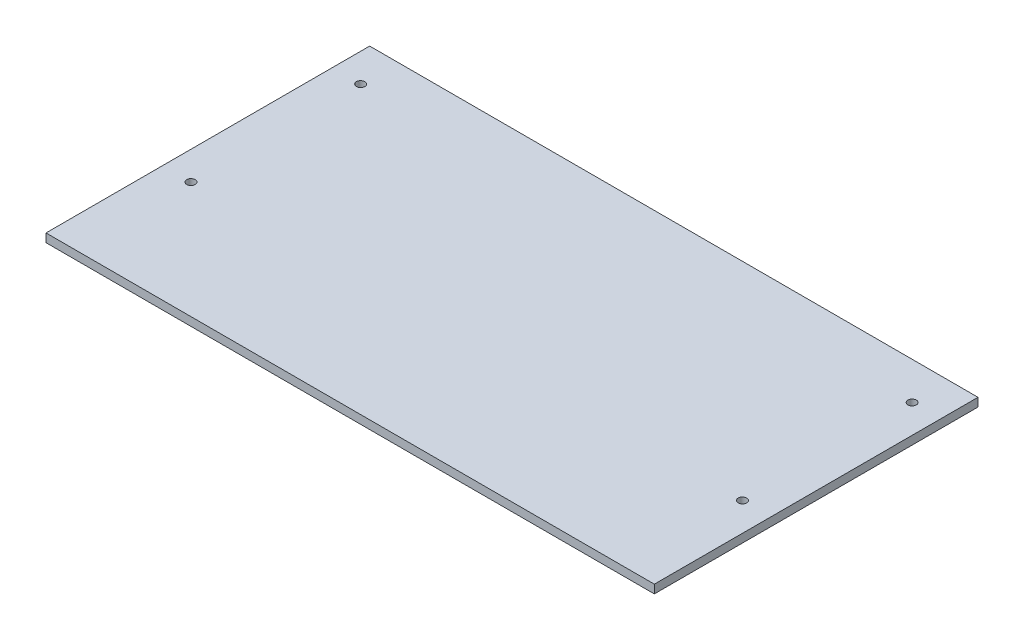
ISO-10303-21;
HEADER;
FILE_DESCRIPTION(('STEP AP214'),'2;1');
FILE_NAME('part.step','',(''),(''),'','','');
FILE_SCHEMA(('AUTOMOTIVE_DESIGN { 1 0 10303 214 1 1 1 1 }'));
ENDSEC;
DATA;
#1=APPLICATION_CONTEXT('core data for automotive mechanical design processes');
#2=APPLICATION_PROTOCOL_DEFINITION('international standard','automotive_design',2000,#1);
#3=PRODUCT_CONTEXT('',#1,'mechanical');
#4=PRODUCT('Part','Part','',(#3));
#5=PRODUCT_RELATED_PRODUCT_CATEGORY('part','',(#4));
#6=PRODUCT_DEFINITION_FORMATION('','',#4);
#7=PRODUCT_DEFINITION_CONTEXT('part definition',#1,'design');
#8=PRODUCT_DEFINITION('design','',#6,#7);
#9=PRODUCT_DEFINITION_SHAPE('','',#8);
#10=(LENGTH_UNIT() NAMED_UNIT(*) SI_UNIT(.MILLI.,.METRE.));
#11=(NAMED_UNIT(*) PLANE_ANGLE_UNIT() SI_UNIT($,.RADIAN.));
#12=(NAMED_UNIT(*) SI_UNIT($,.STERADIAN.) SOLID_ANGLE_UNIT());
#13=UNCERTAINTY_MEASURE_WITH_UNIT(LENGTH_MEASURE(1.E-05),#10,'distance_accuracy_value','');
#14=(GEOMETRIC_REPRESENTATION_CONTEXT(3) GLOBAL_UNCERTAINTY_ASSIGNED_CONTEXT((#13)) GLOBAL_UNIT_ASSIGNED_CONTEXT((#10,
#11,#12)) REPRESENTATION_CONTEXT('',''));
#15=CARTESIAN_POINT('',(0.,0.,0.));
#16=DIRECTION('',(0.,0.,1.));
#17=DIRECTION('',(1.,0.,0.));
#18=AXIS2_PLACEMENT_3D('',#15,#16,#17);
#19=CARTESIAN_POINT('',(0.,3.,0.));
#20=DIRECTION('',(0.,-1.,0.));
#21=DIRECTION('',(0.,0.,-1.));
#22=AXIS2_PLACEMENT_3D('',#19,#20,#21);
#23=PLANE('',#22);
#24=DIRECTION('',(0.,0.,-1.));
#25=VECTOR('',#24,1.);
#26=CARTESIAN_POINT('',(107.545,3.,24.1233569512786));
#27=LINE('',#26,#25);
#28=CARTESIAN_POINT('',(107.545,3.,24.1233569512786));
#29=VERTEX_POINT('',#28);
#30=CARTESIAN_POINT('',(107.545,3.,-90.3123533494948));
#31=VERTEX_POINT('',#30);
#32=EDGE_CURVE('E95',#29,#31,#27,.T.);
#33=ORIENTED_EDGE('',*,*,#32,.T.);
#34=DIRECTION('',(-1.,0.,0.));
#35=VECTOR('',#34,1.);
#36=CARTESIAN_POINT('',(-107.545,3.,-90.3123533494948));
#37=LINE('',#36,#35);
#38=CARTESIAN_POINT('',(-107.545,3.,-90.3123533494948));
#39=VERTEX_POINT('',#38);
#40=EDGE_CURVE('E90',#31,#39,#37,.T.);
#41=ORIENTED_EDGE('',*,*,#40,.T.);
#42=DIRECTION('',(0.,0.,1.));
#43=VECTOR('',#42,1.);
#44=CARTESIAN_POINT('',(-107.545,3.,-90.3123533494948));
#45=LINE('',#44,#43);
#46=CARTESIAN_POINT('',(-107.545,3.,24.1233569512786));
#47=VERTEX_POINT('',#46);
#48=EDGE_CURVE('E93',#39,#47,#45,.T.);
#49=ORIENTED_EDGE('',*,*,#48,.T.);
#50=DIRECTION('',(1.,0.,0.));
#51=VECTOR('',#50,1.);
#52=CARTESIAN_POINT('',(-107.545,3.,24.1233569512786));
#53=LINE('',#52,#51);
#54=EDGE_CURVE('E60',#47,#29,#53,.T.);
#55=ORIENTED_EDGE('',*,*,#54,.T.);
#56=EDGE_LOOP('',(#33,#41,#49,#55));
#57=FACE_BOUND('',#56,.T.);
#58=CARTESIAN_POINT('',(-97.495,3.,-77.0727083333333));
#59=DIRECTION('',(0.,1.,0.));
#60=DIRECTION('',(0.,0.,1.));
#61=AXIS2_PLACEMENT_3D('',#58,#59,#60);
#62=CIRCLE('',#61,1.5);
#63=CARTESIAN_POINT('',(-97.495,3.,-75.5727083333333));
#64=VERTEX_POINT('',#63);
#65=EDGE_CURVE('E110',#64,#64,#62,.T.);
#66=ORIENTED_EDGE('',*,*,#65,.F.);
#67=EDGE_LOOP('',(#66));
#68=FACE_BOUND('',#67,.T.);
#69=CARTESIAN_POINT('',(97.495,3.,-77.0727083333333));
#70=DIRECTION('',(0.,1.,0.));
#71=DIRECTION('',(0.,0.,1.));
#72=AXIS2_PLACEMENT_3D('',#69,#70,#71);
#73=CIRCLE('',#72,1.5);
#74=CARTESIAN_POINT('',(97.495,3.,-75.5727083333333));
#75=VERTEX_POINT('',#74);
#76=EDGE_CURVE('E125',#75,#75,#73,.T.);
#77=ORIENTED_EDGE('',*,*,#76,.F.);
#78=EDGE_LOOP('',(#77));
#79=FACE_BOUND('',#78,.T.);
#80=CARTESIAN_POINT('',(-97.4949999999994,3.,-17.0727083333333));
#81=DIRECTION('',(0.,1.,0.));
#82=DIRECTION('',(0.,0.,1.));
#83=AXIS2_PLACEMENT_3D('',#80,#81,#82);
#84=CIRCLE('',#83,1.5);
#85=CARTESIAN_POINT('',(-97.4949999999994,3.,-15.5727083333333));
#86=VERTEX_POINT('',#85);
#87=EDGE_CURVE('E131',#86,#86,#84,.T.);
#88=ORIENTED_EDGE('',*,*,#87,.F.);
#89=EDGE_LOOP('',(#88));
#90=FACE_BOUND('',#89,.T.);
#91=CARTESIAN_POINT('',(97.4950000000006,3.,-17.0727083333333));
#92=DIRECTION('',(0.,1.,0.));
#93=DIRECTION('',(0.,0.,1.));
#94=AXIS2_PLACEMENT_3D('',#91,#92,#93);
#95=CIRCLE('',#94,1.5);
#96=CARTESIAN_POINT('',(97.4950000000006,3.,-15.5727083333333));
#97=VERTEX_POINT('',#96);
#98=EDGE_CURVE('E137',#97,#97,#95,.T.);
#99=ORIENTED_EDGE('',*,*,#98,.F.);
#100=EDGE_LOOP('',(#99));
#101=FACE_BOUND('',#100,.T.);
#102=ADVANCED_FACE('F43',(#57,#68,#79,#90,#101),#23,.F.);
#103=CARTESIAN_POINT('',(0.,0.,0.));
#104=DIRECTION('',(0.,-1.,0.));
#105=DIRECTION('',(0.,0.,-1.));
#106=AXIS2_PLACEMENT_3D('',#103,#104,#105);
#107=PLANE('',#106);
#108=CARTESIAN_POINT('',(-97.4949999999994,0.,-17.0727083333333));
#109=DIRECTION('',(0.,1.,0.));
#110=DIRECTION('',(0.,0.,1.));
#111=AXIS2_PLACEMENT_3D('',#108,#109,#110);
#112=CIRCLE('',#111,1.5);
#113=CARTESIAN_POINT('',(-97.4949999999994,0.,-15.5727083333333));
#114=VERTEX_POINT('',#113);
#115=EDGE_CURVE('E134',#114,#114,#112,.T.);
#116=ORIENTED_EDGE('',*,*,#115,.T.);
#117=EDGE_LOOP('',(#116));
#118=FACE_BOUND('',#117,.T.);
#119=CARTESIAN_POINT('',(-97.495,0.,-77.0727083333333));
#120=DIRECTION('',(0.,1.,0.));
#121=DIRECTION('',(0.,0.,1.));
#122=AXIS2_PLACEMENT_3D('',#119,#120,#121);
#123=CIRCLE('',#122,1.5);
#124=CARTESIAN_POINT('',(-97.495,0.,-75.5727083333333));
#125=VERTEX_POINT('',#124);
#126=EDGE_CURVE('E122',#125,#125,#123,.T.);
#127=ORIENTED_EDGE('',*,*,#126,.T.);
#128=EDGE_LOOP('',(#127));
#129=FACE_BOUND('',#128,.T.);
#130=DIRECTION('',(0.,0.,-1.));
#131=VECTOR('',#130,1.);
#132=CARTESIAN_POINT('',(107.545,0.,24.1233569512786));
#133=LINE('',#132,#131);
#134=CARTESIAN_POINT('',(107.545,0.,24.1233569512786));
#135=VERTEX_POINT('',#134);
#136=CARTESIAN_POINT('',(107.545,0.,-90.3123533494948));
#137=VERTEX_POINT('',#136);
#138=EDGE_CURVE('E107',#135,#137,#133,.T.);
#139=ORIENTED_EDGE('',*,*,#138,.F.);
#140=DIRECTION('',(1.,0.,0.));
#141=VECTOR('',#140,1.);
#142=CARTESIAN_POINT('',(-107.545,0.,24.1233569512786));
#143=LINE('',#142,#141);
#144=CARTESIAN_POINT('',(-107.545,0.,24.1233569512786));
#145=VERTEX_POINT('',#144);
#146=EDGE_CURVE('E83',#145,#135,#143,.T.);
#147=ORIENTED_EDGE('',*,*,#146,.F.);
#148=DIRECTION('',(0.,0.,1.));
#149=VECTOR('',#148,1.);
#150=CARTESIAN_POINT('',(-107.545,0.,-90.3123533494948));
#151=LINE('',#150,#149);
#152=CARTESIAN_POINT('',(-107.545,0.,-90.3123533494948));
#153=VERTEX_POINT('',#152);
#154=EDGE_CURVE('E77',#153,#145,#151,.T.);
#155=ORIENTED_EDGE('',*,*,#154,.F.);
#156=DIRECTION('',(-1.,0.,0.));
#157=VECTOR('',#156,1.);
#158=CARTESIAN_POINT('',(-107.545,0.,-90.3123533494948));
#159=LINE('',#158,#157);
#160=EDGE_CURVE('E99',#137,#153,#159,.T.);
#161=ORIENTED_EDGE('',*,*,#160,.F.);
#162=EDGE_LOOP('',(#139,#147,#155,#161));
#163=FACE_BOUND('',#162,.T.);
#164=CARTESIAN_POINT('',(97.495,0.,-77.0727083333333));
#165=DIRECTION('',(0.,1.,0.));
#166=DIRECTION('',(0.,0.,1.));
#167=AXIS2_PLACEMENT_3D('',#164,#165,#166);
#168=CIRCLE('',#167,1.5);
#169=CARTESIAN_POINT('',(97.495,0.,-75.5727083333333));
#170=VERTEX_POINT('',#169);
#171=EDGE_CURVE('E128',#170,#170,#168,.T.);
#172=ORIENTED_EDGE('',*,*,#171,.T.);
#173=EDGE_LOOP('',(#172));
#174=FACE_BOUND('',#173,.T.);
#175=CARTESIAN_POINT('',(97.4950000000006,0.,-17.0727083333333));
#176=DIRECTION('',(0.,1.,0.));
#177=DIRECTION('',(0.,0.,1.));
#178=AXIS2_PLACEMENT_3D('',#175,#176,#177);
#179=CIRCLE('',#178,1.5);
#180=CARTESIAN_POINT('',(97.4950000000006,0.,-15.5727083333333));
#181=VERTEX_POINT('',#180);
#182=EDGE_CURVE('E140',#181,#181,#179,.T.);
#183=ORIENTED_EDGE('',*,*,#182,.T.);
#184=EDGE_LOOP('',(#183));
#185=FACE_BOUND('',#184,.T.);
#186=ADVANCED_FACE('F118',(#118,#129,#163,#174,#185),#107,.T.);
#187=CARTESIAN_POINT('',(107.545,3.,24.1233569512786));
#188=DIRECTION('',(-1.,0.,0.));
#189=DIRECTION('',(0.,0.,1.));
#190=AXIS2_PLACEMENT_3D('',#187,#188,#189);
#191=PLANE('',#190);
#192=ORIENTED_EDGE('',*,*,#138,.T.);
#193=DIRECTION('',(0.,-1.,0.));
#194=VECTOR('',#193,1.);
#195=CARTESIAN_POINT('',(107.545,3.,-90.3123533494948));
#196=LINE('',#195,#194);
#197=EDGE_CURVE('E11',#31,#137,#196,.T.);
#198=ORIENTED_EDGE('',*,*,#197,.F.);
#199=ORIENTED_EDGE('',*,*,#32,.F.);
#200=DIRECTION('',(0.,-1.,0.));
#201=VECTOR('',#200,1.);
#202=CARTESIAN_POINT('',(107.545,3.,24.1233569512786));
#203=LINE('',#202,#201);
#204=EDGE_CURVE('E103',#29,#135,#203,.T.);
#205=ORIENTED_EDGE('',*,*,#204,.T.);
#206=EDGE_LOOP('',(#192,#198,#199,#205));
#207=FACE_BOUND('',#206,.T.);
#208=ADVANCED_FACE('F45',(#207),#191,.F.);
#209=CARTESIAN_POINT('',(-107.545,3.,-90.3123533494948));
#210=DIRECTION('',(0.,0.,1.));
#211=DIRECTION('',(1.,0.,0.));
#212=AXIS2_PLACEMENT_3D('',#209,#210,#211);
#213=PLANE('',#212);
#214=ORIENTED_EDGE('',*,*,#160,.T.);
#215=DIRECTION('',(0.,-1.,0.));
#216=VECTOR('',#215,1.);
#217=CARTESIAN_POINT('',(-107.545,3.,-90.3123533494948));
#218=LINE('',#217,#216);
#219=EDGE_CURVE('E52',#39,#153,#218,.T.);
#220=ORIENTED_EDGE('',*,*,#219,.F.);
#221=ORIENTED_EDGE('',*,*,#40,.F.);
#222=ORIENTED_EDGE('',*,*,#197,.T.);
#223=EDGE_LOOP('',(#214,#220,#221,#222));
#224=FACE_BOUND('',#223,.T.);
#225=ADVANCED_FACE('F98',(#224),#213,.F.);
#226=CARTESIAN_POINT('',(-107.545,3.,-90.3123533494948));
#227=DIRECTION('',(1.,0.,0.));
#228=DIRECTION('',(0.,0.,-1.));
#229=AXIS2_PLACEMENT_3D('',#226,#227,#228);
#230=PLANE('',#229);
#231=ORIENTED_EDGE('',*,*,#154,.T.);
#232=DIRECTION('',(0.,-1.,0.));
#233=VECTOR('',#232,1.);
#234=CARTESIAN_POINT('',(-107.545,3.,24.1233569512786));
#235=LINE('',#234,#233);
#236=EDGE_CURVE('E100',#47,#145,#235,.T.);
#237=ORIENTED_EDGE('',*,*,#236,.F.);
#238=ORIENTED_EDGE('',*,*,#48,.F.);
#239=ORIENTED_EDGE('',*,*,#219,.T.);
#240=EDGE_LOOP('',(#231,#237,#238,#239));
#241=FACE_BOUND('',#240,.T.);
#242=ADVANCED_FACE('F101',(#241),#230,.F.);
#243=CARTESIAN_POINT('',(-107.545,3.,24.1233569512786));
#244=DIRECTION('',(0.,0.,-1.));
#245=DIRECTION('',(-1.,0.,0.));
#246=AXIS2_PLACEMENT_3D('',#243,#244,#245);
#247=PLANE('',#246);
#248=ORIENTED_EDGE('',*,*,#146,.T.);
#249=ORIENTED_EDGE('',*,*,#204,.F.);
#250=ORIENTED_EDGE('',*,*,#54,.F.);
#251=ORIENTED_EDGE('',*,*,#236,.T.);
#252=EDGE_LOOP('',(#248,#249,#250,#251));
#253=FACE_BOUND('',#252,.T.);
#254=ADVANCED_FACE('F115',(#253),#247,.F.);
#255=CARTESIAN_POINT('',(-97.495,3.,-77.0727083333333));
#256=DIRECTION('',(0.,-1.,0.));
#257=DIRECTION('',(0.,0.,-1.));
#258=AXIS2_PLACEMENT_3D('',#255,#256,#257);
#259=CYLINDRICAL_SURFACE('',#258,1.5);
#260=ORIENTED_EDGE('',*,*,#65,.T.);
#261=EDGE_LOOP('',(#260));
#262=FACE_BOUND('',#261,.T.);
#263=ORIENTED_EDGE('',*,*,#126,.F.);
#264=EDGE_LOOP('',(#263));
#265=FACE_BOUND('',#264,.T.);
#266=ADVANCED_FACE('F157',(#262,#265),#259,.F.);
#267=CARTESIAN_POINT('',(97.495,3.,-77.0727083333333));
#268=DIRECTION('',(0.,-1.,0.));
#269=DIRECTION('',(0.,0.,-1.));
#270=AXIS2_PLACEMENT_3D('',#267,#268,#269);
#271=CYLINDRICAL_SURFACE('',#270,1.5);
#272=ORIENTED_EDGE('',*,*,#76,.T.);
#273=EDGE_LOOP('',(#272));
#274=FACE_BOUND('',#273,.T.);
#275=ORIENTED_EDGE('',*,*,#171,.F.);
#276=EDGE_LOOP('',(#275));
#277=FACE_BOUND('',#276,.T.);
#278=ADVANCED_FACE('F202',(#274,#277),#271,.F.);
#279=CARTESIAN_POINT('',(-97.4949999999994,3.,-17.0727083333333));
#280=DIRECTION('',(0.,-1.,0.));
#281=DIRECTION('',(0.,0.,-1.));
#282=AXIS2_PLACEMENT_3D('',#279,#280,#281);
#283=CYLINDRICAL_SURFACE('',#282,1.5);
#284=ORIENTED_EDGE('',*,*,#87,.T.);
#285=EDGE_LOOP('',(#284));
#286=FACE_BOUND('',#285,.T.);
#287=ORIENTED_EDGE('',*,*,#115,.F.);
#288=EDGE_LOOP('',(#287));
#289=FACE_BOUND('',#288,.T.);
#290=ADVANCED_FACE('F210',(#286,#289),#283,.F.);
#291=CARTESIAN_POINT('',(97.4950000000006,3.,-17.0727083333333));
#292=DIRECTION('',(0.,-1.,0.));
#293=DIRECTION('',(0.,0.,-1.));
#294=AXIS2_PLACEMENT_3D('',#291,#292,#293);
#295=CYLINDRICAL_SURFACE('',#294,1.5);
#296=ORIENTED_EDGE('',*,*,#98,.T.);
#297=EDGE_LOOP('',(#296));
#298=FACE_BOUND('',#297,.T.);
#299=ORIENTED_EDGE('',*,*,#182,.F.);
#300=EDGE_LOOP('',(#299));
#301=FACE_BOUND('',#300,.T.);
#302=ADVANCED_FACE('F146',(#298,#301),#295,.F.);
#303=CLOSED_SHELL('',(#102,#186,#208,#225,#242,#254,#266,#278,#290,#302));
#304=MANIFOLD_SOLID_BREP('B2',#303);
#305=ADVANCED_BREP_SHAPE_REPRESENTATION('',(#18,#304),#14);
#306=SHAPE_DEFINITION_REPRESENTATION(#9,#305);
ENDSEC;
END-ISO-10303-21;
